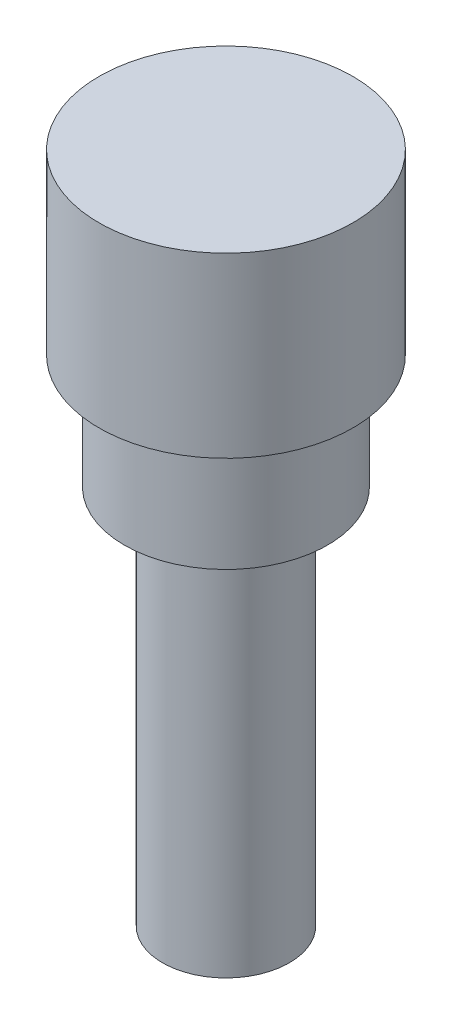
ISO-10303-21;
HEADER;
FILE_DESCRIPTION(('STEP AP214'),'2;1');
FILE_NAME('part.step','',(''),(''),'','','');
FILE_SCHEMA(('AUTOMOTIVE_DESIGN { 1 0 10303 214 1 1 1 1 }'));
ENDSEC;
DATA;
#1=APPLICATION_CONTEXT('core data for automotive mechanical design processes');
#2=APPLICATION_PROTOCOL_DEFINITION('international standard','automotive_design',2000,#1);
#3=PRODUCT_CONTEXT('',#1,'mechanical');
#4=PRODUCT('Part','Part','',(#3));
#5=PRODUCT_RELATED_PRODUCT_CATEGORY('part','',(#4));
#6=PRODUCT_DEFINITION_FORMATION('','',#4);
#7=PRODUCT_DEFINITION_CONTEXT('part definition',#1,'design');
#8=PRODUCT_DEFINITION('design','',#6,#7);
#9=PRODUCT_DEFINITION_SHAPE('','',#8);
#10=(LENGTH_UNIT() NAMED_UNIT(*) SI_UNIT(.MILLI.,.METRE.));
#11=(NAMED_UNIT(*) PLANE_ANGLE_UNIT() SI_UNIT($,.RADIAN.));
#12=(NAMED_UNIT(*) SI_UNIT($,.STERADIAN.) SOLID_ANGLE_UNIT());
#13=UNCERTAINTY_MEASURE_WITH_UNIT(LENGTH_MEASURE(1.E-05),#10,'distance_accuracy_value','');
#14=(GEOMETRIC_REPRESENTATION_CONTEXT(3) GLOBAL_UNCERTAINTY_ASSIGNED_CONTEXT((#13)) GLOBAL_UNIT_ASSIGNED_CONTEXT((#10,
#11,#12)) REPRESENTATION_CONTEXT('',''));
#15=CARTESIAN_POINT('',(0.,0.,0.));
#16=DIRECTION('',(0.,0.,1.));
#17=DIRECTION('',(1.,0.,0.));
#18=AXIS2_PLACEMENT_3D('',#15,#16,#17);
#19=CARTESIAN_POINT('',(0.,0.,0.));
#20=DIRECTION('',(0.,-1.,0.));
#21=DIRECTION('',(0.,0.,-1.));
#22=AXIS2_PLACEMENT_3D('',#19,#20,#21);
#23=PLANE('',#22);
#24=CARTESIAN_POINT('',(0.,0.,0.));
#25=DIRECTION('',(0.,-1.,0.));
#26=DIRECTION('',(0.,0.,-1.));
#27=AXIS2_PLACEMENT_3D('',#24,#25,#26);
#28=CIRCLE('',#27,5.);
#29=CARTESIAN_POINT('',(0.,0.,-5.));
#30=VERTEX_POINT('',#29);
#31=EDGE_CURVE('E10',#30,#30,#28,.T.);
#32=ORIENTED_EDGE('',*,*,#31,.F.);
#33=EDGE_LOOP('',(#32));
#34=FACE_BOUND('',#33,.T.);
#35=ADVANCED_FACE('F35',(#34),#23,.F.);
#36=CARTESIAN_POINT('',(0.,-26.5,0.));
#37=DIRECTION('',(0.,-1.,0.));
#38=DIRECTION('',(0.,0.,-1.));
#39=AXIS2_PLACEMENT_3D('',#36,#37,#38);
#40=CYLINDRICAL_SURFACE('',#39,5.);
#41=CARTESIAN_POINT('',(0.,-7.,0.));
#42=DIRECTION('',(0.,-1.,0.));
#43=DIRECTION('',(0.,0.,-1.));
#44=AXIS2_PLACEMENT_3D('',#41,#42,#43);
#45=CIRCLE('',#44,5.);
#46=CARTESIAN_POINT('',(0.,-7.,-5.));
#47=VERTEX_POINT('',#46);
#48=EDGE_CURVE('E41',#47,#47,#45,.T.);
#49=ORIENTED_EDGE('',*,*,#48,.F.);
#50=EDGE_LOOP('',(#49));
#51=FACE_BOUND('',#50,.T.);
#52=ORIENTED_EDGE('',*,*,#31,.T.);
#53=EDGE_LOOP('',(#52));
#54=FACE_BOUND('',#53,.T.);
#55=ADVANCED_FACE('F83',(#51,#54),#40,.T.);
#56=CARTESIAN_POINT('',(-5.,-7.,0.));
#57=DIRECTION('',(0.,1.,0.));
#58=DIRECTION('',(0.,0.,1.));
#59=AXIS2_PLACEMENT_3D('',#56,#57,#58);
#60=PLANE('',#59);
#61=CARTESIAN_POINT('',(0.,-7.,0.));
#62=DIRECTION('',(0.,-1.,0.));
#63=DIRECTION('',(0.,0.,-1.));
#64=AXIS2_PLACEMENT_3D('',#61,#62,#63);
#65=CIRCLE('',#64,4.);
#66=CARTESIAN_POINT('',(0.,-7.,-4.));
#67=VERTEX_POINT('',#66);
#68=EDGE_CURVE('E45',#67,#67,#65,.T.);
#69=ORIENTED_EDGE('',*,*,#68,.F.);
#70=EDGE_LOOP('',(#69));
#71=FACE_BOUND('',#70,.T.);
#72=ORIENTED_EDGE('',*,*,#48,.T.);
#73=EDGE_LOOP('',(#72));
#74=FACE_BOUND('',#73,.T.);
#75=ADVANCED_FACE('F78',(#71,#74),#60,.F.);
#76=CARTESIAN_POINT('',(0.,-26.5,0.));
#77=DIRECTION('',(0.,-1.,0.));
#78=DIRECTION('',(0.,0.,-1.));
#79=AXIS2_PLACEMENT_3D('',#76,#77,#78);
#80=CYLINDRICAL_SURFACE('',#79,4.);
#81=CARTESIAN_POINT('',(0.,-11.5,0.));
#82=DIRECTION('',(0.,-1.,0.));
#83=DIRECTION('',(0.,0.,-1.));
#84=AXIS2_PLACEMENT_3D('',#81,#82,#83);
#85=CIRCLE('',#84,4.);
#86=CARTESIAN_POINT('',(0.,-11.5,-4.));
#87=VERTEX_POINT('',#86);
#88=EDGE_CURVE('E49',#87,#87,#85,.T.);
#89=ORIENTED_EDGE('',*,*,#88,.F.);
#90=EDGE_LOOP('',(#89));
#91=FACE_BOUND('',#90,.T.);
#92=ORIENTED_EDGE('',*,*,#68,.T.);
#93=EDGE_LOOP('',(#92));
#94=FACE_BOUND('',#93,.T.);
#95=ADVANCED_FACE('F72',(#91,#94),#80,.T.);
#96=CARTESIAN_POINT('',(-4.,-11.5,0.));
#97=DIRECTION('',(0.,1.,0.));
#98=DIRECTION('',(0.,0.,1.));
#99=AXIS2_PLACEMENT_3D('',#96,#97,#98);
#100=PLANE('',#99);
#101=CARTESIAN_POINT('',(0.,-11.5,0.));
#102=DIRECTION('',(0.,-1.,0.));
#103=DIRECTION('',(0.,0.,-1.));
#104=AXIS2_PLACEMENT_3D('',#101,#102,#103);
#105=CIRCLE('',#104,2.5);
#106=CARTESIAN_POINT('',(0.,-11.5,-2.5));
#107=VERTEX_POINT('',#106);
#108=EDGE_CURVE('E54',#107,#107,#105,.T.);
#109=ORIENTED_EDGE('',*,*,#108,.F.);
#110=EDGE_LOOP('',(#109));
#111=FACE_BOUND('',#110,.T.);
#112=ORIENTED_EDGE('',*,*,#88,.T.);
#113=EDGE_LOOP('',(#112));
#114=FACE_BOUND('',#113,.T.);
#115=ADVANCED_FACE('F66',(#111,#114),#100,.F.);
#116=CARTESIAN_POINT('',(0.,-26.5,0.));
#117=DIRECTION('',(0.,-1.,0.));
#118=DIRECTION('',(0.,0.,-1.));
#119=AXIS2_PLACEMENT_3D('',#116,#117,#118);
#120=CYLINDRICAL_SURFACE('',#119,2.5);
#121=CARTESIAN_POINT('',(0.,-26.5,0.));
#122=DIRECTION('',(0.,-1.,0.));
#123=DIRECTION('',(0.,0.,-1.));
#124=AXIS2_PLACEMENT_3D('',#121,#122,#123);
#125=CIRCLE('',#124,2.5);
#126=CARTESIAN_POINT('',(0.,-26.5,-2.5));
#127=VERTEX_POINT('',#126);
#128=EDGE_CURVE('E57',#127,#127,#125,.T.);
#129=ORIENTED_EDGE('',*,*,#128,.F.);
#130=EDGE_LOOP('',(#129));
#131=FACE_BOUND('',#130,.T.);
#132=ORIENTED_EDGE('',*,*,#108,.T.);
#133=EDGE_LOOP('',(#132));
#134=FACE_BOUND('',#133,.T.);
#135=ADVANCED_FACE('F63',(#131,#134),#120,.T.);
#136=CARTESIAN_POINT('',(-2.5,-26.5,0.));
#137=DIRECTION('',(0.,1.,0.));
#138=DIRECTION('',(0.,0.,1.));
#139=AXIS2_PLACEMENT_3D('',#136,#137,#138);
#140=PLANE('',#139);
#141=ORIENTED_EDGE('',*,*,#128,.T.);
#142=EDGE_LOOP('',(#141));
#143=FACE_BOUND('',#142,.T.);
#144=ADVANCED_FACE('F61',(#143),#140,.F.);
#145=CLOSED_SHELL('',(#35,#55,#75,#95,#115,#135,#144));
#146=MANIFOLD_SOLID_BREP('B2',#145);
#147=ADVANCED_BREP_SHAPE_REPRESENTATION('',(#18,#146),#14);
#148=SHAPE_DEFINITION_REPRESENTATION(#9,#147);
ENDSEC;
END-ISO-10303-21;
